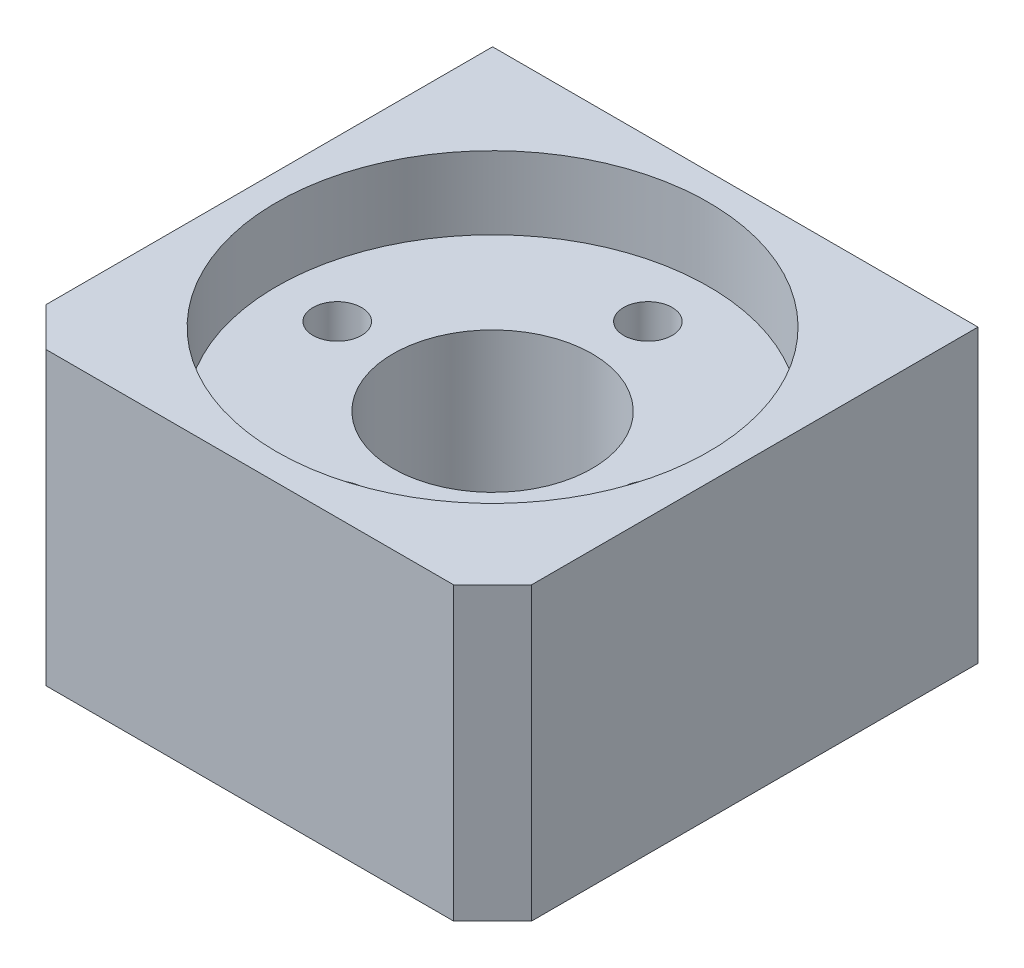
ISO-10303-21;
HEADER;
FILE_DESCRIPTION(('STEP AP214'),'2;1');
FILE_NAME('part.step','',(''),(''),'','','');
FILE_SCHEMA(('AUTOMOTIVE_DESIGN { 1 0 10303 214 1 1 1 1 }'));
ENDSEC;
DATA;
#1=APPLICATION_CONTEXT('core data for automotive mechanical design processes');
#2=APPLICATION_PROTOCOL_DEFINITION('international standard','automotive_design',2000,#1);
#3=PRODUCT_CONTEXT('',#1,'mechanical');
#4=PRODUCT('Part','Part','',(#3));
#5=PRODUCT_RELATED_PRODUCT_CATEGORY('part','',(#4));
#6=PRODUCT_DEFINITION_FORMATION('','',#4);
#7=PRODUCT_DEFINITION_CONTEXT('part definition',#1,'design');
#8=PRODUCT_DEFINITION('design','',#6,#7);
#9=PRODUCT_DEFINITION_SHAPE('','',#8);
#10=(LENGTH_UNIT() NAMED_UNIT(*) SI_UNIT(.MILLI.,.METRE.));
#11=(NAMED_UNIT(*) PLANE_ANGLE_UNIT() SI_UNIT($,.RADIAN.));
#12=(NAMED_UNIT(*) SI_UNIT($,.STERADIAN.) SOLID_ANGLE_UNIT());
#13=UNCERTAINTY_MEASURE_WITH_UNIT(LENGTH_MEASURE(1.E-05),#10,'distance_accuracy_value','');
#14=(GEOMETRIC_REPRESENTATION_CONTEXT(3) GLOBAL_UNCERTAINTY_ASSIGNED_CONTEXT((#13)) GLOBAL_UNIT_ASSIGNED_CONTEXT((#10,
#11,#12)) REPRESENTATION_CONTEXT('',''));
#15=CARTESIAN_POINT('',(0.,0.,0.));
#16=DIRECTION('',(0.,0.,1.));
#17=DIRECTION('',(1.,0.,0.));
#18=AXIS2_PLACEMENT_3D('',#15,#16,#17);
#19=CARTESIAN_POINT('',(12.5,15.,-12.5));
#20=DIRECTION('',(-1.,0.,0.));
#21=DIRECTION('',(0.,0.,1.));
#22=AXIS2_PLACEMENT_3D('',#19,#20,#21);
#23=PLANE('',#22);
#24=DIRECTION('',(0.,0.,-1.));
#25=VECTOR('',#24,1.);
#26=CARTESIAN_POINT('',(12.5,15.,-12.5));
#27=LINE('',#26,#25);
#28=CARTESIAN_POINT('',(12.5,15.,10.5));
#29=VERTEX_POINT('',#28);
#30=CARTESIAN_POINT('',(12.5,15.,-12.5));
#31=VERTEX_POINT('',#30);
#32=EDGE_CURVE('E206',#29,#31,#27,.T.);
#33=ORIENTED_EDGE('',*,*,#32,.F.);
#34=DIRECTION('',(0.,-1.,0.));
#35=VECTOR('',#34,1.);
#36=CARTESIAN_POINT('',(12.5,15.,10.5));
#37=LINE('',#36,#35);
#38=CARTESIAN_POINT('',(12.5,0.,10.5));
#39=VERTEX_POINT('',#38);
#40=EDGE_CURVE('E11',#29,#39,#37,.T.);
#41=ORIENTED_EDGE('',*,*,#40,.T.);
#42=DIRECTION('',(0.,0.,-1.));
#43=VECTOR('',#42,1.);
#44=CARTESIAN_POINT('',(12.5,0.,-12.5));
#45=LINE('',#44,#43);
#46=CARTESIAN_POINT('',(12.5,0.,-12.5));
#47=VERTEX_POINT('',#46);
#48=EDGE_CURVE('E202',#39,#47,#45,.T.);
#49=ORIENTED_EDGE('',*,*,#48,.T.);
#50=DIRECTION('',(0.,-1.,0.));
#51=VECTOR('',#50,1.);
#52=CARTESIAN_POINT('',(12.5,15.,-12.5));
#53=LINE('',#52,#51);
#54=EDGE_CURVE('E234',#31,#47,#53,.T.);
#55=ORIENTED_EDGE('',*,*,#54,.F.);
#56=EDGE_LOOP('',(#33,#41,#49,#55));
#57=FACE_BOUND('',#56,.T.);
#58=ADVANCED_FACE('F57',(#57),#23,.F.);
#59=CARTESIAN_POINT('',(-12.5,15.,-12.5));
#60=DIRECTION('',(0.,0.,1.));
#61=DIRECTION('',(1.,0.,0.));
#62=AXIS2_PLACEMENT_3D('',#59,#60,#61);
#63=PLANE('',#62);
#64=CARTESIAN_POINT('',(-7.5,7.5,-12.5));
#65=DIRECTION('',(0.,0.,-1.));
#66=DIRECTION('',(-1.,0.,0.));
#67=AXIS2_PLACEMENT_3D('',#64,#65,#66);
#68=CIRCLE('',#67,1.65);
#69=CARTESIAN_POINT('',(-9.15,7.5,-12.5));
#70=VERTEX_POINT('',#69);
#71=EDGE_CURVE('E143',#70,#70,#68,.T.);
#72=ORIENTED_EDGE('',*,*,#71,.F.);
#73=EDGE_LOOP('',(#72));
#74=FACE_BOUND('',#73,.T.);
#75=CARTESIAN_POINT('',(7.5,7.5,-12.5));
#76=DIRECTION('',(0.,0.,-1.));
#77=DIRECTION('',(-1.,0.,0.));
#78=AXIS2_PLACEMENT_3D('',#75,#76,#77);
#79=CIRCLE('',#78,1.65);
#80=CARTESIAN_POINT('',(5.85,7.5,-12.5));
#81=VERTEX_POINT('',#80);
#82=EDGE_CURVE('E142',#81,#81,#79,.T.);
#83=ORIENTED_EDGE('',*,*,#82,.F.);
#84=EDGE_LOOP('',(#83));
#85=FACE_BOUND('',#84,.T.);
#86=DIRECTION('',(-1.,0.,0.));
#87=VECTOR('',#86,1.);
#88=CARTESIAN_POINT('',(-12.5,0.,-12.5));
#89=LINE('',#88,#87);
#90=CARTESIAN_POINT('',(-12.5,0.,-12.5));
#91=VERTEX_POINT('',#90);
#92=EDGE_CURVE('E222',#47,#91,#89,.T.);
#93=ORIENTED_EDGE('',*,*,#92,.T.);
#94=DIRECTION('',(0.,-1.,0.));
#95=VECTOR('',#94,1.);
#96=CARTESIAN_POINT('',(-12.5,15.,-12.5));
#97=LINE('',#96,#95);
#98=CARTESIAN_POINT('',(-12.5,15.,-12.5));
#99=VERTEX_POINT('',#98);
#100=EDGE_CURVE('E219',#99,#91,#97,.T.);
#101=ORIENTED_EDGE('',*,*,#100,.F.);
#102=DIRECTION('',(-1.,0.,0.));
#103=VECTOR('',#102,1.);
#104=CARTESIAN_POINT('',(-12.5,15.,-12.5));
#105=LINE('',#104,#103);
#106=EDGE_CURVE('E209',#31,#99,#105,.T.);
#107=ORIENTED_EDGE('',*,*,#106,.F.);
#108=ORIENTED_EDGE('',*,*,#54,.T.);
#109=EDGE_LOOP('',(#93,#101,#107,#108));
#110=FACE_BOUND('',#109,.T.);
#111=ADVANCED_FACE('F274',(#74,#85,#110),#63,.F.);
#112=CARTESIAN_POINT('',(-12.5,15.,-12.5));
#113=DIRECTION('',(1.,0.,0.));
#114=DIRECTION('',(0.,0.,-1.));
#115=AXIS2_PLACEMENT_3D('',#112,#113,#114);
#116=PLANE('',#115);
#117=DIRECTION('',(0.,0.,1.));
#118=VECTOR('',#117,1.);
#119=CARTESIAN_POINT('',(-12.5,0.,-12.5));
#120=LINE('',#119,#118);
#121=CARTESIAN_POINT('',(-12.5,0.,10.5));
#122=VERTEX_POINT('',#121);
#123=EDGE_CURVE('E225',#91,#122,#120,.T.);
#124=ORIENTED_EDGE('',*,*,#123,.T.);
#125=DIRECTION('',(0.,1.,0.));
#126=VECTOR('',#125,1.);
#127=CARTESIAN_POINT('',(-12.5,15.,10.5));
#128=LINE('',#127,#126);
#129=CARTESIAN_POINT('',(-12.5,15.,10.5));
#130=VERTEX_POINT('',#129);
#131=EDGE_CURVE('E82',#122,#130,#128,.T.);
#132=ORIENTED_EDGE('',*,*,#131,.T.);
#133=DIRECTION('',(0.,0.,1.));
#134=VECTOR('',#133,1.);
#135=CARTESIAN_POINT('',(-12.5,15.,-12.5));
#136=LINE('',#135,#134);
#137=EDGE_CURVE('E213',#99,#130,#136,.T.);
#138=ORIENTED_EDGE('',*,*,#137,.F.);
#139=ORIENTED_EDGE('',*,*,#100,.T.);
#140=EDGE_LOOP('',(#124,#132,#138,#139));
#141=FACE_BOUND('',#140,.T.);
#142=ADVANCED_FACE('F270',(#141),#116,.F.);
#143=CARTESIAN_POINT('',(-12.5,15.,12.5));
#144=DIRECTION('',(0.,0.,-1.));
#145=DIRECTION('',(-1.,0.,0.));
#146=AXIS2_PLACEMENT_3D('',#143,#144,#145);
#147=PLANE('',#146);
#148=DIRECTION('',(1.,0.,0.));
#149=VECTOR('',#148,1.);
#150=CARTESIAN_POINT('',(-12.5,15.,12.5));
#151=LINE('',#150,#149);
#152=CARTESIAN_POINT('',(-10.5,15.,12.5));
#153=VERTEX_POINT('',#152);
#154=CARTESIAN_POINT('',(10.5,15.,12.5));
#155=VERTEX_POINT('',#154);
#156=EDGE_CURVE('E216',#153,#155,#151,.T.);
#157=ORIENTED_EDGE('',*,*,#156,.F.);
#158=DIRECTION('',(0.,-1.,0.));
#159=VECTOR('',#158,1.);
#160=CARTESIAN_POINT('',(-10.5,15.,12.5));
#161=LINE('',#160,#159);
#162=CARTESIAN_POINT('',(-10.5,0.,12.5));
#163=VERTEX_POINT('',#162);
#164=EDGE_CURVE('E241',#153,#163,#161,.T.);
#165=ORIENTED_EDGE('',*,*,#164,.T.);
#166=DIRECTION('',(1.,0.,0.));
#167=VECTOR('',#166,1.);
#168=CARTESIAN_POINT('',(-12.5,0.,12.5));
#169=LINE('',#168,#167);
#170=CARTESIAN_POINT('',(10.5,0.,12.5));
#171=VERTEX_POINT('',#170);
#172=EDGE_CURVE('E210',#163,#171,#169,.T.);
#173=ORIENTED_EDGE('',*,*,#172,.T.);
#174=DIRECTION('',(0.,1.,0.));
#175=VECTOR('',#174,1.);
#176=CARTESIAN_POINT('',(10.5,15.,12.5));
#177=LINE('',#176,#175);
#178=EDGE_CURVE('E238',#171,#155,#177,.T.);
#179=ORIENTED_EDGE('',*,*,#178,.T.);
#180=EDGE_LOOP('',(#157,#165,#173,#179));
#181=FACE_BOUND('',#180,.T.);
#182=ADVANCED_FACE('F262',(#181),#147,.F.);
#183=CARTESIAN_POINT('',(0.,15.,0.));
#184=DIRECTION('',(0.,1.,0.));
#185=DIRECTION('',(0.,0.,1.));
#186=AXIS2_PLACEMENT_3D('',#183,#184,#185);
#187=PLANE('',#186);
#188=CARTESIAN_POINT('',(0.,15.,0.));
#189=DIRECTION('',(0.,1.,0.));
#190=DIRECTION('',(0.,0.,1.));
#191=AXIS2_PLACEMENT_3D('',#188,#189,#190);
#192=CIRCLE('',#191,11.125);
#193=CARTESIAN_POINT('',(0.,15.,11.125));
#194=VERTEX_POINT('',#193);
#195=EDGE_CURVE('E194',#194,#194,#192,.T.);
#196=ORIENTED_EDGE('',*,*,#195,.F.);
#197=EDGE_LOOP('',(#196));
#198=FACE_BOUND('',#197,.T.);
#199=ORIENTED_EDGE('',*,*,#137,.T.);
#200=DIRECTION('',(-0.707106781186546,0.,-0.707106781186549));
#201=VECTOR('',#200,1.);
#202=CARTESIAN_POINT('',(-11.5,15.,11.5));
#203=LINE('',#202,#201);
#204=EDGE_CURVE('E67',#130,#153,#203,.F.);
#205=ORIENTED_EDGE('',*,*,#204,.T.);
#206=ORIENTED_EDGE('',*,*,#156,.T.);
#207=DIRECTION('',(-0.707106781186549,0.,0.707106781186546));
#208=VECTOR('',#207,1.);
#209=CARTESIAN_POINT('',(11.5,15.,11.5));
#210=LINE('',#209,#208);
#211=EDGE_CURVE('E74',#155,#29,#210,.F.);
#212=ORIENTED_EDGE('',*,*,#211,.T.);
#213=ORIENTED_EDGE('',*,*,#32,.T.);
#214=ORIENTED_EDGE('',*,*,#106,.T.);
#215=EDGE_LOOP('',(#199,#205,#206,#212,#213,#214));
#216=FACE_BOUND('',#215,.T.);
#217=ADVANCED_FACE('F258',(#198,#216),#187,.T.);
#218=CARTESIAN_POINT('',(0.,0.,0.));
#219=DIRECTION('',(0.,1.,0.));
#220=DIRECTION('',(0.,0.,1.));
#221=AXIS2_PLACEMENT_3D('',#218,#219,#220);
#222=PLANE('',#221);
#223=CARTESIAN_POINT('',(0.,0.,0.));
#224=DIRECTION('',(0.,1.,0.));
#225=DIRECTION('',(0.,0.,1.));
#226=AXIS2_PLACEMENT_3D('',#223,#224,#225);
#227=CIRCLE('',#226,5.125);
#228=CARTESIAN_POINT('',(0.,0.,5.125));
#229=VERTEX_POINT('',#228);
#230=EDGE_CURVE('E190',#229,#229,#227,.T.);
#231=ORIENTED_EDGE('',*,*,#230,.T.);
#232=EDGE_LOOP('',(#231));
#233=FACE_BOUND('',#232,.T.);
#234=ORIENTED_EDGE('',*,*,#172,.F.);
#235=DIRECTION('',(0.707106781186546,0.,0.707106781186549));
#236=VECTOR('',#235,1.);
#237=CARTESIAN_POINT('',(-10.5,0.,12.5));
#238=LINE('',#237,#236);
#239=EDGE_CURVE('E248',#163,#122,#238,.F.);
#240=ORIENTED_EDGE('',*,*,#239,.T.);
#241=ORIENTED_EDGE('',*,*,#123,.F.);
#242=ORIENTED_EDGE('',*,*,#92,.F.);
#243=ORIENTED_EDGE('',*,*,#48,.F.);
#244=DIRECTION('',(0.707106781186549,0.,-0.707106781186546));
#245=VECTOR('',#244,1.);
#246=CARTESIAN_POINT('',(12.5,0.,10.5));
#247=LINE('',#246,#245);
#248=EDGE_CURVE('E245',#39,#171,#247,.F.);
#249=ORIENTED_EDGE('',*,*,#248,.T.);
#250=EDGE_LOOP('',(#234,#240,#241,#242,#243,#249));
#251=FACE_BOUND('',#250,.T.);
#252=ADVANCED_FACE('F268',(#233,#251),#222,.F.);
#253=CARTESIAN_POINT('',(0.,11.25,0.));
#254=DIRECTION('',(0.,1.,0.));
#255=DIRECTION('',(0.,0.,1.));
#256=AXIS2_PLACEMENT_3D('',#253,#254,#255);
#257=CYLINDRICAL_SURFACE('',#256,11.125);
#258=CARTESIAN_POINT('',(0.,11.25,0.));
#259=DIRECTION('',(0.,1.,0.));
#260=DIRECTION('',(0.,0.,1.));
#261=AXIS2_PLACEMENT_3D('',#258,#259,#260);
#262=CIRCLE('',#261,11.125);
#263=CARTESIAN_POINT('',(0.,11.25,11.125));
#264=VERTEX_POINT('',#263);
#265=EDGE_CURVE('E198',#264,#264,#262,.T.);
#266=ORIENTED_EDGE('',*,*,#265,.F.);
#267=EDGE_LOOP('',(#266));
#268=FACE_BOUND('',#267,.T.);
#269=ORIENTED_EDGE('',*,*,#195,.T.);
#270=EDGE_LOOP('',(#269));
#271=FACE_BOUND('',#270,.T.);
#272=ADVANCED_FACE('F305',(#268,#271),#257,.F.);
#273=CARTESIAN_POINT('',(0.,11.25,0.));
#274=DIRECTION('',(0.,1.,0.));
#275=DIRECTION('',(0.,0.,1.));
#276=AXIS2_PLACEMENT_3D('',#273,#274,#275);
#277=PLANE('',#276);
#278=CARTESIAN_POINT('',(8.,11.25,0.));
#279=DIRECTION('',(0.,1.,0.));
#280=DIRECTION('',(0.,0.,1.));
#281=AXIS2_PLACEMENT_3D('',#278,#279,#280);
#282=CIRCLE('',#281,1.24999999999999);
#283=CARTESIAN_POINT('',(8.,11.25,1.24999999999999));
#284=VERTEX_POINT('',#283);
#285=EDGE_CURVE('E157',#284,#284,#282,.T.);
#286=ORIENTED_EDGE('',*,*,#285,.F.);
#287=EDGE_LOOP('',(#286));
#288=FACE_BOUND('',#287,.T.);
#289=CARTESIAN_POINT('',(0.,11.25,-8.));
#290=DIRECTION('',(0.,1.,0.));
#291=DIRECTION('',(0.,0.,1.));
#292=AXIS2_PLACEMENT_3D('',#289,#290,#291);
#293=CIRCLE('',#292,1.24999999999999);
#294=CARTESIAN_POINT('',(0.,11.25,-6.75000000000001));
#295=VERTEX_POINT('',#294);
#296=EDGE_CURVE('E165',#295,#295,#293,.T.);
#297=ORIENTED_EDGE('',*,*,#296,.F.);
#298=EDGE_LOOP('',(#297));
#299=FACE_BOUND('',#298,.T.);
#300=CARTESIAN_POINT('',(0.,11.25,8.));
#301=DIRECTION('',(0.,1.,0.));
#302=DIRECTION('',(0.,0.,1.));
#303=AXIS2_PLACEMENT_3D('',#300,#301,#302);
#304=CIRCLE('',#303,1.24999999999999);
#305=CARTESIAN_POINT('',(0.,11.25,9.24999999999999));
#306=VERTEX_POINT('',#305);
#307=EDGE_CURVE('E173',#306,#306,#304,.T.);
#308=ORIENTED_EDGE('',*,*,#307,.F.);
#309=EDGE_LOOP('',(#308));
#310=FACE_BOUND('',#309,.T.);
#311=CARTESIAN_POINT('',(-8.,11.25,0.));
#312=DIRECTION('',(0.,1.,0.));
#313=DIRECTION('',(0.,0.,1.));
#314=AXIS2_PLACEMENT_3D('',#311,#312,#313);
#315=CIRCLE('',#314,1.24999999999999);
#316=CARTESIAN_POINT('',(-8.,11.25,1.24999999999999));
#317=VERTEX_POINT('',#316);
#318=EDGE_CURVE('E181',#317,#317,#315,.T.);
#319=ORIENTED_EDGE('',*,*,#318,.F.);
#320=EDGE_LOOP('',(#319));
#321=FACE_BOUND('',#320,.T.);
#322=CARTESIAN_POINT('',(0.,11.25,0.));
#323=DIRECTION('',(0.,1.,0.));
#324=DIRECTION('',(0.,0.,1.));
#325=AXIS2_PLACEMENT_3D('',#322,#323,#324);
#326=CIRCLE('',#325,5.125);
#327=CARTESIAN_POINT('',(0.,11.25,5.125));
#328=VERTEX_POINT('',#327);
#329=EDGE_CURVE('E189',#328,#328,#326,.T.);
#330=ORIENTED_EDGE('',*,*,#329,.F.);
#331=EDGE_LOOP('',(#330));
#332=FACE_BOUND('',#331,.T.);
#333=ORIENTED_EDGE('',*,*,#265,.T.);
#334=EDGE_LOOP('',(#333));
#335=FACE_BOUND('',#334,.T.);
#336=ADVANCED_FACE('F312',(#288,#299,#310,#321,#332,#335),#277,.T.);
#337=CARTESIAN_POINT('',(0.,0.,0.));
#338=DIRECTION('',(0.,1.,0.));
#339=DIRECTION('',(0.,0.,1.));
#340=AXIS2_PLACEMENT_3D('',#337,#338,#339);
#341=CYLINDRICAL_SURFACE('',#340,5.125);
#342=ORIENTED_EDGE('',*,*,#230,.F.);
#343=EDGE_LOOP('',(#342));
#344=FACE_BOUND('',#343,.T.);
#345=ORIENTED_EDGE('',*,*,#329,.T.);
#346=EDGE_LOOP('',(#345));
#347=FACE_BOUND('',#346,.T.);
#348=ADVANCED_FACE('F316',(#344,#347),#341,.F.);
#349=CARTESIAN_POINT('',(-8.,5.25,0.));
#350=DIRECTION('',(0.,1.,0.));
#351=DIRECTION('',(0.,0.,1.));
#352=AXIS2_PLACEMENT_3D('',#349,#350,#351);
#353=CONICAL_SURFACE('',#352,1.25,1.02974425867665);
#354=CARTESIAN_POINT('',(-8.,4.49892422621555,0.));
#355=VERTEX_POINT('',#354);
#356=VERTEX_LOOP('',#355);
#357=FACE_BOUND('',#356,.T.);
#358=CARTESIAN_POINT('',(-8.,5.25,0.));
#359=DIRECTION('',(0.,1.,0.));
#360=DIRECTION('',(0.,0.,1.));
#361=AXIS2_PLACEMENT_3D('',#358,#359,#360);
#362=CIRCLE('',#361,1.25);
#363=CARTESIAN_POINT('',(-8.,5.25,1.25));
#364=VERTEX_POINT('',#363);
#365=EDGE_CURVE('E185',#364,#364,#362,.T.);
#366=ORIENTED_EDGE('',*,*,#365,.T.);
#367=EDGE_LOOP('',(#366));
#368=FACE_BOUND('',#367,.T.);
#369=ADVANCED_FACE('F320',(#357,#368),#353,.F.);
#370=CARTESIAN_POINT('',(-8.,11.25,0.));
#371=DIRECTION('',(0.,1.,0.));
#372=DIRECTION('',(0.,0.,1.));
#373=AXIS2_PLACEMENT_3D('',#370,#371,#372);
#374=CYLINDRICAL_SURFACE('',#373,1.24999999999999);
#375=ORIENTED_EDGE('',*,*,#365,.F.);
#376=EDGE_LOOP('',(#375));
#377=FACE_BOUND('',#376,.T.);
#378=ORIENTED_EDGE('',*,*,#318,.T.);
#379=EDGE_LOOP('',(#378));
#380=FACE_BOUND('',#379,.T.);
#381=ADVANCED_FACE('F324',(#377,#380),#374,.F.);
#382=CARTESIAN_POINT('',(0.,5.25,8.));
#383=DIRECTION('',(0.,1.,0.));
#384=DIRECTION('',(0.,0.,1.));
#385=AXIS2_PLACEMENT_3D('',#382,#383,#384);
#386=CONICAL_SURFACE('',#385,1.25,1.02974425867665);
#387=CARTESIAN_POINT('',(0.,4.49892422621555,8.));
#388=VERTEX_POINT('',#387);
#389=VERTEX_LOOP('',#388);
#390=FACE_BOUND('',#389,.T.);
#391=CARTESIAN_POINT('',(0.,5.25,8.));
#392=DIRECTION('',(0.,1.,0.));
#393=DIRECTION('',(0.,0.,1.));
#394=AXIS2_PLACEMENT_3D('',#391,#392,#393);
#395=CIRCLE('',#394,1.25);
#396=CARTESIAN_POINT('',(0.,5.25,9.25));
#397=VERTEX_POINT('',#396);
#398=EDGE_CURVE('E177',#397,#397,#395,.T.);
#399=ORIENTED_EDGE('',*,*,#398,.T.);
#400=EDGE_LOOP('',(#399));
#401=FACE_BOUND('',#400,.T.);
#402=ADVANCED_FACE('F328',(#390,#401),#386,.F.);
#403=CARTESIAN_POINT('',(0.,11.25,8.));
#404=DIRECTION('',(0.,1.,0.));
#405=DIRECTION('',(0.,0.,1.));
#406=AXIS2_PLACEMENT_3D('',#403,#404,#405);
#407=CYLINDRICAL_SURFACE('',#406,1.24999999999999);
#408=ORIENTED_EDGE('',*,*,#398,.F.);
#409=EDGE_LOOP('',(#408));
#410=FACE_BOUND('',#409,.T.);
#411=ORIENTED_EDGE('',*,*,#307,.T.);
#412=EDGE_LOOP('',(#411));
#413=FACE_BOUND('',#412,.T.);
#414=ADVANCED_FACE('F332',(#410,#413),#407,.F.);
#415=CARTESIAN_POINT('',(0.,5.25,-8.));
#416=DIRECTION('',(0.,1.,0.));
#417=DIRECTION('',(0.,0.,1.));
#418=AXIS2_PLACEMENT_3D('',#415,#416,#417);
#419=CONICAL_SURFACE('',#418,1.25,1.02974425867665);
#420=CARTESIAN_POINT('',(0.,4.49892422621555,-8.));
#421=VERTEX_POINT('',#420);
#422=VERTEX_LOOP('',#421);
#423=FACE_BOUND('',#422,.T.);
#424=CARTESIAN_POINT('',(0.,5.25,-8.));
#425=DIRECTION('',(0.,1.,0.));
#426=DIRECTION('',(0.,0.,1.));
#427=AXIS2_PLACEMENT_3D('',#424,#425,#426);
#428=CIRCLE('',#427,1.25);
#429=CARTESIAN_POINT('',(0.,5.25,-6.75));
#430=VERTEX_POINT('',#429);
#431=EDGE_CURVE('E169',#430,#430,#428,.T.);
#432=ORIENTED_EDGE('',*,*,#431,.T.);
#433=EDGE_LOOP('',(#432));
#434=FACE_BOUND('',#433,.T.);
#435=ADVANCED_FACE('F336',(#423,#434),#419,.F.);
#436=CARTESIAN_POINT('',(0.,11.25,-8.));
#437=DIRECTION('',(0.,1.,0.));
#438=DIRECTION('',(0.,0.,1.));
#439=AXIS2_PLACEMENT_3D('',#436,#437,#438);
#440=CYLINDRICAL_SURFACE('',#439,1.24999999999999);
#441=ORIENTED_EDGE('',*,*,#431,.F.);
#442=EDGE_LOOP('',(#441));
#443=FACE_BOUND('',#442,.T.);
#444=ORIENTED_EDGE('',*,*,#296,.T.);
#445=EDGE_LOOP('',(#444));
#446=FACE_BOUND('',#445,.T.);
#447=ADVANCED_FACE('F340',(#443,#446),#440,.F.);
#448=CARTESIAN_POINT('',(8.,5.25,0.));
#449=DIRECTION('',(0.,1.,0.));
#450=DIRECTION('',(0.,0.,1.));
#451=AXIS2_PLACEMENT_3D('',#448,#449,#450);
#452=CONICAL_SURFACE('',#451,1.25,1.02974425867665);
#453=CARTESIAN_POINT('',(8.,4.49892422621555,0.));
#454=VERTEX_POINT('',#453);
#455=VERTEX_LOOP('',#454);
#456=FACE_BOUND('',#455,.T.);
#457=CARTESIAN_POINT('',(8.,5.25,0.));
#458=DIRECTION('',(0.,1.,0.));
#459=DIRECTION('',(0.,0.,1.));
#460=AXIS2_PLACEMENT_3D('',#457,#458,#459);
#461=CIRCLE('',#460,1.25);
#462=CARTESIAN_POINT('',(8.,5.25,1.25));
#463=VERTEX_POINT('',#462);
#464=EDGE_CURVE('E161',#463,#463,#461,.T.);
#465=ORIENTED_EDGE('',*,*,#464,.T.);
#466=EDGE_LOOP('',(#465));
#467=FACE_BOUND('',#466,.T.);
#468=ADVANCED_FACE('F344',(#456,#467),#452,.F.);
#469=CARTESIAN_POINT('',(8.,11.25,0.));
#470=DIRECTION('',(0.,1.,0.));
#471=DIRECTION('',(0.,0.,1.));
#472=AXIS2_PLACEMENT_3D('',#469,#470,#471);
#473=CYLINDRICAL_SURFACE('',#472,1.24999999999999);
#474=ORIENTED_EDGE('',*,*,#464,.F.);
#475=EDGE_LOOP('',(#474));
#476=FACE_BOUND('',#475,.T.);
#477=ORIENTED_EDGE('',*,*,#285,.T.);
#478=EDGE_LOOP('',(#477));
#479=FACE_BOUND('',#478,.T.);
#480=ADVANCED_FACE('F348',(#476,#479),#473,.F.);
#481=CARTESIAN_POINT('',(7.5,7.5,-4.5));
#482=DIRECTION('',(0.,0.,-1.));
#483=DIRECTION('',(-1.,0.,0.));
#484=AXIS2_PLACEMENT_3D('',#481,#482,#483);
#485=CONICAL_SURFACE('',#484,1.65,1.02974425867665);
#486=CARTESIAN_POINT('',(7.5,7.5,-3.50857997860453));
#487=VERTEX_POINT('',#486);
#488=VERTEX_LOOP('',#487);
#489=FACE_BOUND('',#488,.T.);
#490=CARTESIAN_POINT('',(7.5,7.5,-4.5));
#491=DIRECTION('',(0.,0.,-1.));
#492=DIRECTION('',(-1.,0.,0.));
#493=AXIS2_PLACEMENT_3D('',#490,#491,#492);
#494=CIRCLE('',#493,1.65);
#495=CARTESIAN_POINT('',(5.85,7.5,-4.5));
#496=VERTEX_POINT('',#495);
#497=EDGE_CURVE('E149',#496,#496,#494,.T.);
#498=ORIENTED_EDGE('',*,*,#497,.T.);
#499=EDGE_LOOP('',(#498));
#500=FACE_BOUND('',#499,.T.);
#501=ADVANCED_FACE('F352',(#489,#500),#485,.F.);
#502=CARTESIAN_POINT('',(7.5,7.5,-12.5));
#503=DIRECTION('',(0.,0.,-1.));
#504=DIRECTION('',(-1.,0.,0.));
#505=AXIS2_PLACEMENT_3D('',#502,#503,#504);
#506=CYLINDRICAL_SURFACE('',#505,1.65);
#507=ORIENTED_EDGE('',*,*,#497,.F.);
#508=EDGE_LOOP('',(#507));
#509=FACE_BOUND('',#508,.T.);
#510=ORIENTED_EDGE('',*,*,#82,.T.);
#511=EDGE_LOOP('',(#510));
#512=FACE_BOUND('',#511,.T.);
#513=ADVANCED_FACE('F135',(#509,#512),#506,.F.);
#514=CARTESIAN_POINT('',(-7.5,7.5,-4.5));
#515=DIRECTION('',(0.,0.,-1.));
#516=DIRECTION('',(-1.,0.,0.));
#517=AXIS2_PLACEMENT_3D('',#514,#515,#516);
#518=CONICAL_SURFACE('',#517,1.65,1.02974425867665);
#519=CARTESIAN_POINT('',(-7.5,7.5,-3.50857997860453));
#520=VERTEX_POINT('',#519);
#521=VERTEX_LOOP('',#520);
#522=FACE_BOUND('',#521,.T.);
#523=CARTESIAN_POINT('',(-7.5,7.5,-4.5));
#524=DIRECTION('',(0.,0.,-1.));
#525=DIRECTION('',(-1.,0.,0.));
#526=AXIS2_PLACEMENT_3D('',#523,#524,#525);
#527=CIRCLE('',#526,1.65);
#528=CARTESIAN_POINT('',(-9.15,7.5,-4.5));
#529=VERTEX_POINT('',#528);
#530=EDGE_CURVE('E139',#529,#529,#527,.T.);
#531=ORIENTED_EDGE('',*,*,#530,.T.);
#532=EDGE_LOOP('',(#531));
#533=FACE_BOUND('',#532,.T.);
#534=ADVANCED_FACE('F131',(#522,#533),#518,.F.);
#535=CARTESIAN_POINT('',(-7.5,7.5,-12.5));
#536=DIRECTION('',(0.,0.,-1.));
#537=DIRECTION('',(-1.,0.,0.));
#538=AXIS2_PLACEMENT_3D('',#535,#536,#537);
#539=CYLINDRICAL_SURFACE('',#538,1.65);
#540=ORIENTED_EDGE('',*,*,#530,.F.);
#541=EDGE_LOOP('',(#540));
#542=FACE_BOUND('',#541,.T.);
#543=ORIENTED_EDGE('',*,*,#71,.T.);
#544=EDGE_LOOP('',(#543));
#545=FACE_BOUND('',#544,.T.);
#546=ADVANCED_FACE('F134',(#542,#545),#539,.F.);
#547=CARTESIAN_POINT('',(-10.5,15.,12.5));
#548=DIRECTION('',(0.707106781186549,0.,-0.707106781186546));
#549=DIRECTION('',(0.,-1.,0.));
#550=AXIS2_PLACEMENT_3D('',#547,#548,#549);
#551=PLANE('',#550);
#552=ORIENTED_EDGE('',*,*,#204,.F.);
#553=ORIENTED_EDGE('',*,*,#131,.F.);
#554=ORIENTED_EDGE('',*,*,#239,.F.);
#555=ORIENTED_EDGE('',*,*,#164,.F.);
#556=EDGE_LOOP('',(#552,#553,#554,#555));
#557=FACE_BOUND('',#556,.T.);
#558=ADVANCED_FACE('F265',(#557),#551,.F.);
#559=CARTESIAN_POINT('',(12.5,15.,10.5));
#560=DIRECTION('',(-0.707106781186546,0.,-0.707106781186549));
#561=DIRECTION('',(0.,-1.,0.));
#562=AXIS2_PLACEMENT_3D('',#559,#560,#561);
#563=PLANE('',#562);
#564=ORIENTED_EDGE('',*,*,#211,.F.);
#565=ORIENTED_EDGE('',*,*,#178,.F.);
#566=ORIENTED_EDGE('',*,*,#248,.F.);
#567=ORIENTED_EDGE('',*,*,#40,.F.);
#568=EDGE_LOOP('',(#564,#565,#566,#567));
#569=FACE_BOUND('',#568,.T.);
#570=ADVANCED_FACE('F60',(#569),#563,.F.);
#571=CLOSED_SHELL('',(#58,#111,#142,#182,#217,#252,#272,#336,#348,#369,#381,#402,#414,#435,#447,
#468,#480,#501,#513,#534,#546,#558,#570));
#572=MANIFOLD_SOLID_BREP('B2',#571);
#573=ADVANCED_BREP_SHAPE_REPRESENTATION('',(#18,#572),#14);
#574=SHAPE_DEFINITION_REPRESENTATION(#9,#573);
ENDSEC;
END-ISO-10303-21;
